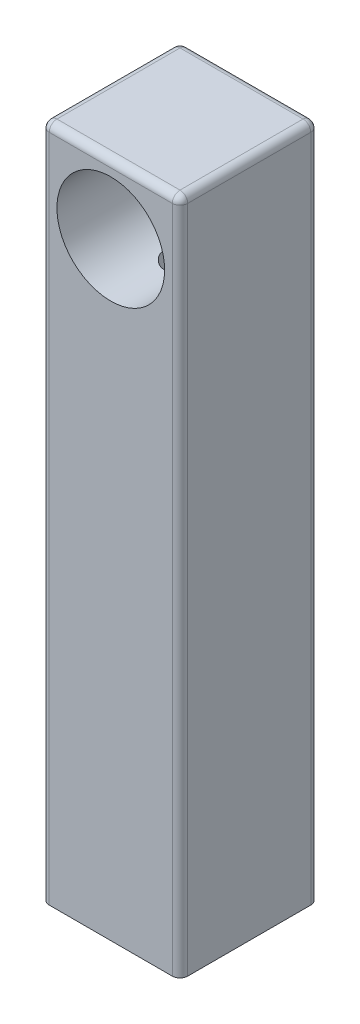
ISO-10303-21;
HEADER;
FILE_DESCRIPTION(('STEP AP214'),'2;1');
FILE_NAME('part.step','',(''),(''),'','','');
FILE_SCHEMA(('AUTOMOTIVE_DESIGN { 1 0 10303 214 1 1 1 1 }'));
ENDSEC;
DATA;
#1=APPLICATION_CONTEXT('core data for automotive mechanical design processes');
#2=APPLICATION_PROTOCOL_DEFINITION('international standard','automotive_design',2000,#1);
#3=PRODUCT_CONTEXT('',#1,'mechanical');
#4=PRODUCT('Part','Part','',(#3));
#5=PRODUCT_RELATED_PRODUCT_CATEGORY('part','',(#4));
#6=PRODUCT_DEFINITION_FORMATION('','',#4);
#7=PRODUCT_DEFINITION_CONTEXT('part definition',#1,'design');
#8=PRODUCT_DEFINITION('design','',#6,#7);
#9=PRODUCT_DEFINITION_SHAPE('','',#8);
#10=(LENGTH_UNIT() NAMED_UNIT(*) SI_UNIT(.MILLI.,.METRE.));
#11=(NAMED_UNIT(*) PLANE_ANGLE_UNIT() SI_UNIT($,.RADIAN.));
#12=(NAMED_UNIT(*) SI_UNIT($,.STERADIAN.) SOLID_ANGLE_UNIT());
#13=UNCERTAINTY_MEASURE_WITH_UNIT(LENGTH_MEASURE(1.E-05),#10,'distance_accuracy_value','');
#14=(GEOMETRIC_REPRESENTATION_CONTEXT(3) GLOBAL_UNCERTAINTY_ASSIGNED_CONTEXT((#13)) GLOBAL_UNIT_ASSIGNED_CONTEXT((#10,
#11,#12)) REPRESENTATION_CONTEXT('',''));
#15=CARTESIAN_POINT('',(0.,0.,0.));
#16=DIRECTION('',(0.,0.,1.));
#17=DIRECTION('',(1.,0.,0.));
#18=AXIS2_PLACEMENT_3D('',#15,#16,#17);
#19=CARTESIAN_POINT('',(-24.257,279.4,-24.3295714285714));
#20=DIRECTION('',(0.,-1.,0.));
#21=DIRECTION('',(0.,0.,-1.));
#22=AXIS2_PLACEMENT_3D('',#19,#20,#21);
#23=CYLINDRICAL_SURFACE('',#22,3.175);
#24=DIRECTION('',(0.,-1.,0.));
#25=VECTOR('',#24,1.);
#26=CARTESIAN_POINT('',(-27.432,279.4,-24.3295714285714));
#27=LINE('',#26,#25);
#28=CARTESIAN_POINT('',(-27.432,276.225,-24.3295714285714));
#29=VERTEX_POINT('',#28);
#30=CARTESIAN_POINT('',(-27.432,0.,-24.3295714285714));
#31=VERTEX_POINT('',#30);
#32=EDGE_CURVE('E114',#29,#31,#27,.T.);
#33=ORIENTED_EDGE('',*,*,#32,.F.);
#34=CARTESIAN_POINT('',(-24.257,276.225,-24.3295714285714));
#35=DIRECTION('',(0.,-1.,0.));
#36=DIRECTION('',(0.,0.,-1.));
#37=AXIS2_PLACEMENT_3D('',#34,#35,#36);
#38=CIRCLE('',#37,3.175);
#39=CARTESIAN_POINT('',(-24.257,276.225,-27.5045714285714));
#40=VERTEX_POINT('',#39);
#41=EDGE_CURVE('E187',#29,#40,#38,.T.);
#42=ORIENTED_EDGE('',*,*,#41,.T.);
#43=DIRECTION('',(0.,-1.,0.));
#44=VECTOR('',#43,1.);
#45=CARTESIAN_POINT('',(-24.257,279.4,-27.5045714285714));
#46=LINE('',#45,#44);
#47=CARTESIAN_POINT('',(-24.257,0.,-27.5045714285714));
#48=VERTEX_POINT('',#47);
#49=EDGE_CURVE('E139',#40,#48,#46,.T.);
#50=ORIENTED_EDGE('',*,*,#49,.T.);
#51=CARTESIAN_POINT('',(-24.257,0.,-24.3295714285714));
#52=DIRECTION('',(0.,1.,0.));
#53=DIRECTION('',(0.,0.,1.));
#54=AXIS2_PLACEMENT_3D('',#51,#52,#53);
#55=CIRCLE('',#54,3.175);
#56=EDGE_CURVE('E132',#48,#31,#55,.T.);
#57=ORIENTED_EDGE('',*,*,#56,.T.);
#58=EDGE_LOOP('',(#33,#42,#50,#57));
#59=FACE_BOUND('',#58,.T.);
#60=ADVANCED_FACE('F33',(#59),#23,.T.);
#61=CARTESIAN_POINT('',(-27.432,279.4,-24.3295714285714));
#62=DIRECTION('',(1.,0.,0.));
#63=DIRECTION('',(0.,0.,-1.));
#64=AXIS2_PLACEMENT_3D('',#61,#62,#63);
#65=PLANE('',#64);
#66=DIRECTION('',(0.,-1.,0.));
#67=VECTOR('',#66,1.);
#68=CARTESIAN_POINT('',(-27.432,279.4,26.4704285714285));
#69=LINE('',#68,#67);
#70=CARTESIAN_POINT('',(-27.432,276.225,26.4704285714285));
#71=VERTEX_POINT('',#70);
#72=CARTESIAN_POINT('',(-27.432,0.,26.4704285714285));
#73=VERTEX_POINT('',#72);
#74=EDGE_CURVE('E126',#71,#73,#69,.T.);
#75=ORIENTED_EDGE('',*,*,#74,.F.);
#76=DIRECTION('',(0.,0.,1.));
#77=VECTOR('',#76,1.);
#78=CARTESIAN_POINT('',(-27.432,276.225,-24.3295714285714));
#79=LINE('',#78,#77);
#80=EDGE_CURVE('E121',#71,#29,#79,.F.);
#81=ORIENTED_EDGE('',*,*,#80,.T.);
#82=ORIENTED_EDGE('',*,*,#32,.T.);
#83=DIRECTION('',(0.,0.,1.));
#84=VECTOR('',#83,1.);
#85=CARTESIAN_POINT('',(-27.432,0.,-24.3295714285714));
#86=LINE('',#85,#84);
#87=EDGE_CURVE('E118',#31,#73,#86,.T.);
#88=ORIENTED_EDGE('',*,*,#87,.T.);
#89=EDGE_LOOP('',(#75,#81,#82,#88));
#90=FACE_BOUND('',#89,.T.);
#91=ADVANCED_FACE('F117',(#90),#65,.F.);
#92=CARTESIAN_POINT('',(-24.257,279.4,26.4704285714286));
#93=DIRECTION('',(0.,-1.,0.));
#94=DIRECTION('',(0.,0.,-1.));
#95=AXIS2_PLACEMENT_3D('',#92,#93,#94);
#96=CYLINDRICAL_SURFACE('',#95,3.175);
#97=DIRECTION('',(0.,-1.,0.));
#98=VECTOR('',#97,1.);
#99=CARTESIAN_POINT('',(-24.257,279.4,29.6454285714286));
#100=LINE('',#99,#98);
#101=CARTESIAN_POINT('',(-24.257,276.225,29.6454285714286));
#102=VERTEX_POINT('',#101);
#103=CARTESIAN_POINT('',(-24.257,0.,29.6454285714286));
#104=VERTEX_POINT('',#103);
#105=EDGE_CURVE('E171',#102,#104,#100,.T.);
#106=ORIENTED_EDGE('',*,*,#105,.F.);
#107=CARTESIAN_POINT('',(-24.257,276.225,26.4704285714286));
#108=DIRECTION('',(0.,-1.,0.));
#109=DIRECTION('',(0.,0.,-1.));
#110=AXIS2_PLACEMENT_3D('',#107,#108,#109);
#111=CIRCLE('',#110,3.175);
#112=EDGE_CURVE('E190',#102,#71,#111,.T.);
#113=ORIENTED_EDGE('',*,*,#112,.T.);
#114=ORIENTED_EDGE('',*,*,#74,.T.);
#115=CARTESIAN_POINT('',(-24.257,0.,26.4704285714286));
#116=DIRECTION('',(0.,1.,0.));
#117=DIRECTION('',(0.,0.,1.));
#118=AXIS2_PLACEMENT_3D('',#115,#116,#117);
#119=CIRCLE('',#118,3.175);
#120=EDGE_CURVE('E136',#73,#104,#119,.T.);
#121=ORIENTED_EDGE('',*,*,#120,.T.);
#122=EDGE_LOOP('',(#106,#113,#114,#121));
#123=FACE_BOUND('',#122,.T.);
#124=ADVANCED_FACE('F271',(#123),#96,.T.);
#125=CARTESIAN_POINT('',(-24.257,279.4,29.6454285714286));
#126=DIRECTION('',(0.,0.,-1.));
#127=DIRECTION('',(-1.,0.,0.));
#128=AXIS2_PLACEMENT_3D('',#125,#126,#127);
#129=PLANE('',#128);
#130=CARTESIAN_POINT('',(1.14300000000002,250.825,29.6454285714286));
#131=DIRECTION('',(0.,0.,1.));
#132=DIRECTION('',(1.,0.,0.));
#133=AXIS2_PLACEMENT_3D('',#130,#131,#132);
#134=CIRCLE('',#133,22.225);
#135=CARTESIAN_POINT('',(23.368,250.825,29.6454285714286));
#136=VERTEX_POINT('',#135);
#137=EDGE_CURVE('E230',#136,#136,#134,.T.);
#138=ORIENTED_EDGE('',*,*,#137,.F.);
#139=EDGE_LOOP('',(#138));
#140=FACE_BOUND('',#139,.T.);
#141=DIRECTION('',(0.,-1.,0.));
#142=VECTOR('',#141,1.);
#143=CARTESIAN_POINT('',(26.543,279.4,29.6454285714286));
#144=LINE('',#143,#142);
#145=CARTESIAN_POINT('',(26.543,276.225,29.6454285714286));
#146=VERTEX_POINT('',#145);
#147=CARTESIAN_POINT('',(26.543,0.,29.6454285714286));
#148=VERTEX_POINT('',#147);
#149=EDGE_CURVE('E169',#146,#148,#144,.T.);
#150=ORIENTED_EDGE('',*,*,#149,.F.);
#151=DIRECTION('',(1.,0.,0.));
#152=VECTOR('',#151,1.);
#153=CARTESIAN_POINT('',(-24.257,276.225,29.6454285714286));
#154=LINE('',#153,#152);
#155=EDGE_CURVE('E192',#146,#102,#154,.F.);
#156=ORIENTED_EDGE('',*,*,#155,.T.);
#157=ORIENTED_EDGE('',*,*,#105,.T.);
#158=DIRECTION('',(1.,0.,0.));
#159=VECTOR('',#158,1.);
#160=CARTESIAN_POINT('',(-24.257,0.,29.6454285714286));
#161=LINE('',#160,#159);
#162=EDGE_CURVE('E148',#104,#148,#161,.T.);
#163=ORIENTED_EDGE('',*,*,#162,.T.);
#164=EDGE_LOOP('',(#150,#156,#157,#163));
#165=FACE_BOUND('',#164,.T.);
#166=ADVANCED_FACE('F336',(#140,#165),#129,.F.);
#167=CARTESIAN_POINT('',(26.543,279.4,26.4704285714286));
#168=DIRECTION('',(0.,-1.,0.));
#169=DIRECTION('',(0.,0.,-1.));
#170=AXIS2_PLACEMENT_3D('',#167,#168,#169);
#171=CYLINDRICAL_SURFACE('',#170,3.175);
#172=DIRECTION('',(0.,-1.,0.));
#173=VECTOR('',#172,1.);
#174=CARTESIAN_POINT('',(29.718,279.4,26.4704285714285));
#175=LINE('',#174,#173);
#176=CARTESIAN_POINT('',(29.718,276.225,26.4704285714285));
#177=VERTEX_POINT('',#176);
#178=CARTESIAN_POINT('',(29.718,0.,26.4704285714285));
#179=VERTEX_POINT('',#178);
#180=EDGE_CURVE('E167',#177,#179,#175,.T.);
#181=ORIENTED_EDGE('',*,*,#180,.F.);
#182=CARTESIAN_POINT('',(26.543,276.225,26.4704285714286));
#183=DIRECTION('',(0.,-1.,0.));
#184=DIRECTION('',(0.,0.,-1.));
#185=AXIS2_PLACEMENT_3D('',#182,#183,#184);
#186=CIRCLE('',#185,3.175);
#187=EDGE_CURVE('E46',#177,#146,#186,.T.);
#188=ORIENTED_EDGE('',*,*,#187,.T.);
#189=ORIENTED_EDGE('',*,*,#149,.T.);
#190=CARTESIAN_POINT('',(26.543,0.,26.4704285714286));
#191=DIRECTION('',(0.,1.,0.));
#192=DIRECTION('',(0.,0.,1.));
#193=AXIS2_PLACEMENT_3D('',#190,#191,#192);
#194=CIRCLE('',#193,3.175);
#195=EDGE_CURVE('E151',#148,#179,#194,.T.);
#196=ORIENTED_EDGE('',*,*,#195,.T.);
#197=EDGE_LOOP('',(#181,#188,#189,#196));
#198=FACE_BOUND('',#197,.T.);
#199=ADVANCED_FACE('F334',(#198),#171,.T.);
#200=CARTESIAN_POINT('',(29.718,279.4,-24.3295714285714));
#201=DIRECTION('',(1.,0.,0.));
#202=DIRECTION('',(0.,0.,-1.));
#203=AXIS2_PLACEMENT_3D('',#200,#201,#202);
#204=PLANE('',#203);
#205=DIRECTION('',(0.,-1.,0.));
#206=VECTOR('',#205,1.);
#207=CARTESIAN_POINT('',(29.718,279.4,-24.3295714285714));
#208=LINE('',#207,#206);
#209=CARTESIAN_POINT('',(29.718,276.225,-24.3295714285714));
#210=VERTEX_POINT('',#209);
#211=CARTESIAN_POINT('',(29.718,0.,-24.3295714285714));
#212=VERTEX_POINT('',#211);
#213=EDGE_CURVE('E165',#210,#212,#208,.T.);
#214=ORIENTED_EDGE('',*,*,#213,.F.);
#215=DIRECTION('',(0.,0.,1.));
#216=VECTOR('',#215,1.);
#217=CARTESIAN_POINT('',(29.718,276.225,-24.3295714285714));
#218=LINE('',#217,#216);
#219=EDGE_CURVE('E11',#210,#177,#218,.T.);
#220=ORIENTED_EDGE('',*,*,#219,.T.);
#221=ORIENTED_EDGE('',*,*,#180,.T.);
#222=DIRECTION('',(0.,0.,1.));
#223=VECTOR('',#222,1.);
#224=CARTESIAN_POINT('',(29.718,0.,-24.3295714285714));
#225=LINE('',#224,#223);
#226=EDGE_CURVE('E154',#212,#179,#225,.T.);
#227=ORIENTED_EDGE('',*,*,#226,.F.);
#228=EDGE_LOOP('',(#214,#220,#221,#227));
#229=FACE_BOUND('',#228,.T.);
#230=ADVANCED_FACE('F333',(#229),#204,.T.);
#231=CARTESIAN_POINT('',(26.543,279.4,-24.3295714285714));
#232=DIRECTION('',(0.,-1.,0.));
#233=DIRECTION('',(0.,0.,-1.));
#234=AXIS2_PLACEMENT_3D('',#231,#232,#233);
#235=CYLINDRICAL_SURFACE('',#234,3.175);
#236=DIRECTION('',(0.,-1.,0.));
#237=VECTOR('',#236,1.);
#238=CARTESIAN_POINT('',(26.543,279.4,-27.5045714285714));
#239=LINE('',#238,#237);
#240=CARTESIAN_POINT('',(26.543,276.225,-27.5045714285714));
#241=VERTEX_POINT('',#240);
#242=CARTESIAN_POINT('',(26.543,0.,-27.5045714285714));
#243=VERTEX_POINT('',#242);
#244=EDGE_CURVE('E163',#241,#243,#239,.T.);
#245=ORIENTED_EDGE('',*,*,#244,.F.);
#246=CARTESIAN_POINT('',(26.543,276.225,-24.3295714285714));
#247=DIRECTION('',(0.,-1.,0.));
#248=DIRECTION('',(0.,0.,-1.));
#249=AXIS2_PLACEMENT_3D('',#246,#247,#248);
#250=CIRCLE('',#249,3.175);
#251=EDGE_CURVE('E125',#241,#210,#250,.T.);
#252=ORIENTED_EDGE('',*,*,#251,.T.);
#253=ORIENTED_EDGE('',*,*,#213,.T.);
#254=CARTESIAN_POINT('',(26.543,0.,-24.3295714285714));
#255=DIRECTION('',(0.,-1.,0.));
#256=DIRECTION('',(0.,0.,-1.));
#257=AXIS2_PLACEMENT_3D('',#254,#255,#256);
#258=CIRCLE('',#257,3.175);
#259=EDGE_CURVE('E157',#243,#212,#258,.T.);
#260=ORIENTED_EDGE('',*,*,#259,.F.);
#261=EDGE_LOOP('',(#245,#252,#253,#260));
#262=FACE_BOUND('',#261,.T.);
#263=ADVANCED_FACE('F330',(#262),#235,.T.);
#264=CARTESIAN_POINT('',(-24.257,279.4,-27.5045714285714));
#265=DIRECTION('',(0.,0.,-1.));
#266=DIRECTION('',(-1.,0.,0.));
#267=AXIS2_PLACEMENT_3D('',#264,#265,#266);
#268=PLANE('',#267);
#269=ORIENTED_EDGE('',*,*,#49,.F.);
#270=DIRECTION('',(1.,0.,0.));
#271=VECTOR('',#270,1.);
#272=CARTESIAN_POINT('',(-24.257,276.225,-27.5045714285714));
#273=LINE('',#272,#271);
#274=EDGE_CURVE('E176',#40,#241,#273,.T.);
#275=ORIENTED_EDGE('',*,*,#274,.T.);
#276=ORIENTED_EDGE('',*,*,#244,.T.);
#277=DIRECTION('',(1.,0.,0.));
#278=VECTOR('',#277,1.);
#279=CARTESIAN_POINT('',(-24.257,0.,-27.5045714285714));
#280=LINE('',#279,#278);
#281=EDGE_CURVE('E160',#48,#243,#280,.T.);
#282=ORIENTED_EDGE('',*,*,#281,.F.);
#283=EDGE_LOOP('',(#269,#275,#276,#282));
#284=FACE_BOUND('',#283,.T.);
#285=ADVANCED_FACE('F324',(#284),#268,.T.);
#286=CARTESIAN_POINT('',(-24.257,279.4,-24.3295714285714));
#287=DIRECTION('',(0.,1.,0.));
#288=DIRECTION('',(0.,0.,1.));
#289=AXIS2_PLACEMENT_3D('',#286,#287,#288);
#290=PLANE('',#289);
#291=DIRECTION('',(0.,0.,1.));
#292=VECTOR('',#291,1.);
#293=CARTESIAN_POINT('',(26.543,279.4,-24.3295714285714));
#294=LINE('',#293,#292);
#295=CARTESIAN_POINT('',(26.543,279.4,26.4704285714286));
#296=VERTEX_POINT('',#295);
#297=CARTESIAN_POINT('',(26.543,279.4,-24.3295714285714));
#298=VERTEX_POINT('',#297);
#299=EDGE_CURVE('E178',#296,#298,#294,.F.);
#300=ORIENTED_EDGE('',*,*,#299,.T.);
#301=DIRECTION('',(1.,0.,0.));
#302=VECTOR('',#301,1.);
#303=CARTESIAN_POINT('',(-24.257,279.4,-24.3295714285714));
#304=LINE('',#303,#302);
#305=CARTESIAN_POINT('',(-24.257,279.4,-24.3295714285714));
#306=VERTEX_POINT('',#305);
#307=EDGE_CURVE('E184',#298,#306,#304,.F.);
#308=ORIENTED_EDGE('',*,*,#307,.T.);
#309=DIRECTION('',(0.,0.,1.));
#310=VECTOR('',#309,1.);
#311=CARTESIAN_POINT('',(-24.257,279.4,26.4704285714285));
#312=LINE('',#311,#310);
#313=CARTESIAN_POINT('',(-24.257,279.4,26.4704285714286));
#314=VERTEX_POINT('',#313);
#315=EDGE_CURVE('E182',#306,#314,#312,.T.);
#316=ORIENTED_EDGE('',*,*,#315,.T.);
#317=DIRECTION('',(1.,0.,0.));
#318=VECTOR('',#317,1.);
#319=CARTESIAN_POINT('',(26.543,279.4,26.4704285714286));
#320=LINE('',#319,#318);
#321=EDGE_CURVE('E180',#314,#296,#320,.T.);
#322=ORIENTED_EDGE('',*,*,#321,.T.);
#323=EDGE_LOOP('',(#300,#308,#316,#322));
#324=FACE_BOUND('',#323,.T.);
#325=ADVANCED_FACE('F317',(#324),#290,.T.);
#326=CARTESIAN_POINT('',(-24.257,0.,-24.3295714285714));
#327=DIRECTION('',(0.,1.,0.));
#328=DIRECTION('',(0.,0.,1.));
#329=AXIS2_PLACEMENT_3D('',#326,#327,#328);
#330=PLANE('',#329);
#331=CARTESIAN_POINT('',(1.14300000000001,0.,1.07042857142859));
#332=DIRECTION('',(0.,1.,0.));
#333=DIRECTION('',(0.,0.,1.));
#334=AXIS2_PLACEMENT_3D('',#331,#332,#333);
#335=CIRCLE('',#334,6.35);
#336=CARTESIAN_POINT('',(1.14300000000001,0.,7.42042857142859));
#337=VERTEX_POINT('',#336);
#338=EDGE_CURVE('E215',#337,#337,#335,.T.);
#339=ORIENTED_EDGE('',*,*,#338,.T.);
#340=EDGE_LOOP('',(#339));
#341=FACE_BOUND('',#340,.T.);
#342=CARTESIAN_POINT('',(15.4305,0.,15.3579285714286));
#343=DIRECTION('',(0.,1.,0.));
#344=DIRECTION('',(0.,0.,1.));
#345=AXIS2_PLACEMENT_3D('',#342,#343,#344);
#346=CIRCLE('',#345,4.96062);
#347=CARTESIAN_POINT('',(15.4305,0.,20.3185485714286));
#348=VERTEX_POINT('',#347);
#349=EDGE_CURVE('E232',#348,#348,#346,.T.);
#350=ORIENTED_EDGE('',*,*,#349,.T.);
#351=EDGE_LOOP('',(#350));
#352=FACE_BOUND('',#351,.T.);
#353=CARTESIAN_POINT('',(-13.1445,0.,-13.2170714285714));
#354=DIRECTION('',(0.,1.,0.));
#355=DIRECTION('',(0.,0.,1.));
#356=AXIS2_PLACEMENT_3D('',#353,#354,#355);
#357=CIRCLE('',#356,4.96062);
#358=CARTESIAN_POINT('',(-13.1445,0.,-8.25645142857141));
#359=VERTEX_POINT('',#358);
#360=EDGE_CURVE('E238',#359,#359,#357,.T.);
#361=ORIENTED_EDGE('',*,*,#360,.T.);
#362=EDGE_LOOP('',(#361));
#363=FACE_BOUND('',#362,.T.);
#364=CARTESIAN_POINT('',(15.4305,0.,-13.2170714285714));
#365=DIRECTION('',(0.,1.,0.));
#366=DIRECTION('',(0.,0.,1.));
#367=AXIS2_PLACEMENT_3D('',#364,#365,#366);
#368=CIRCLE('',#367,4.96062);
#369=CARTESIAN_POINT('',(15.4305,0.,-8.25645142857141));
#370=VERTEX_POINT('',#369);
#371=EDGE_CURVE('E226',#370,#370,#368,.T.);
#372=ORIENTED_EDGE('',*,*,#371,.T.);
#373=EDGE_LOOP('',(#372));
#374=FACE_BOUND('',#373,.T.);
#375=CARTESIAN_POINT('',(-13.1445,0.,15.3579285714286));
#376=DIRECTION('',(0.,1.,0.));
#377=DIRECTION('',(0.,0.,1.));
#378=AXIS2_PLACEMENT_3D('',#375,#376,#377);
#379=CIRCLE('',#378,4.96062);
#380=CARTESIAN_POINT('',(-13.1445,0.,20.3185485714286));
#381=VERTEX_POINT('',#380);
#382=EDGE_CURVE('E143',#381,#381,#379,.T.);
#383=ORIENTED_EDGE('',*,*,#382,.T.);
#384=EDGE_LOOP('',(#383));
#385=FACE_BOUND('',#384,.T.);
#386=ORIENTED_EDGE('',*,*,#56,.F.);
#387=ORIENTED_EDGE('',*,*,#281,.T.);
#388=ORIENTED_EDGE('',*,*,#259,.T.);
#389=ORIENTED_EDGE('',*,*,#226,.T.);
#390=ORIENTED_EDGE('',*,*,#195,.F.);
#391=ORIENTED_EDGE('',*,*,#162,.F.);
#392=ORIENTED_EDGE('',*,*,#120,.F.);
#393=ORIENTED_EDGE('',*,*,#87,.F.);
#394=EDGE_LOOP('',(#386,#387,#388,#389,#390,#391,#392,#393));
#395=FACE_BOUND('',#394,.T.);
#396=ADVANCED_FACE('F130',(#341,#352,#363,#374,#385,#395),#330,.F.);
#397=CARTESIAN_POINT('',(-13.1445,25.4,15.3579285714286));
#398=DIRECTION('',(0.,-1.,0.));
#399=DIRECTION('',(0.,0.,-1.));
#400=AXIS2_PLACEMENT_3D('',#397,#398,#399);
#401=CYLINDRICAL_SURFACE('',#400,4.96062);
#402=CARTESIAN_POINT('',(-13.1445,25.4,15.3579285714286));
#403=DIRECTION('',(0.,1.,0.));
#404=DIRECTION('',(0.,0.,1.));
#405=AXIS2_PLACEMENT_3D('',#402,#403,#404);
#406=CIRCLE('',#405,4.96062);
#407=CARTESIAN_POINT('',(-13.1445,25.4,20.3185485714286));
#408=VERTEX_POINT('',#407);
#409=EDGE_CURVE('E140',#408,#408,#406,.T.);
#410=ORIENTED_EDGE('',*,*,#409,.T.);
#411=EDGE_LOOP('',(#410));
#412=FACE_BOUND('',#411,.T.);
#413=ORIENTED_EDGE('',*,*,#382,.F.);
#414=EDGE_LOOP('',(#413));
#415=FACE_BOUND('',#414,.T.);
#416=ADVANCED_FACE('F262',(#412,#415),#401,.F.);
#417=CARTESIAN_POINT('',(-13.1445,25.4,15.3579285714286));
#418=DIRECTION('',(0.,1.,0.));
#419=DIRECTION('',(0.,0.,1.));
#420=AXIS2_PLACEMENT_3D('',#417,#418,#419);
#421=PLANE('',#420);
#422=ORIENTED_EDGE('',*,*,#409,.F.);
#423=EDGE_LOOP('',(#422));
#424=FACE_BOUND('',#423,.T.);
#425=ADVANCED_FACE('F252',(#424),#421,.F.);
#426=CARTESIAN_POINT('',(15.4305,25.4,-13.2170714285714));
#427=DIRECTION('',(0.,-1.,0.));
#428=DIRECTION('',(0.,0.,-1.));
#429=AXIS2_PLACEMENT_3D('',#426,#427,#428);
#430=CYLINDRICAL_SURFACE('',#429,4.96062);
#431=CARTESIAN_POINT('',(15.4305,25.4,-13.2170714285714));
#432=DIRECTION('',(0.,1.,0.));
#433=DIRECTION('',(0.,0.,1.));
#434=AXIS2_PLACEMENT_3D('',#431,#432,#433);
#435=CIRCLE('',#434,4.96062);
#436=CARTESIAN_POINT('',(15.4305,25.4,-8.25645142857141));
#437=VERTEX_POINT('',#436);
#438=EDGE_CURVE('E221',#437,#437,#435,.T.);
#439=ORIENTED_EDGE('',*,*,#438,.T.);
#440=EDGE_LOOP('',(#439));
#441=FACE_BOUND('',#440,.T.);
#442=ORIENTED_EDGE('',*,*,#371,.F.);
#443=EDGE_LOOP('',(#442));
#444=FACE_BOUND('',#443,.T.);
#445=ADVANCED_FACE('F249',(#441,#444),#430,.F.);
#446=CARTESIAN_POINT('',(15.4305,25.4,-13.2170714285714));
#447=DIRECTION('',(0.,1.,0.));
#448=DIRECTION('',(0.,0.,1.));
#449=AXIS2_PLACEMENT_3D('',#446,#447,#448);
#450=PLANE('',#449);
#451=ORIENTED_EDGE('',*,*,#438,.F.);
#452=EDGE_LOOP('',(#451));
#453=FACE_BOUND('',#452,.T.);
#454=ADVANCED_FACE('F251',(#453),#450,.F.);
#455=CARTESIAN_POINT('',(-13.1445,25.4,-13.2170714285714));
#456=DIRECTION('',(0.,-1.,0.));
#457=DIRECTION('',(0.,0.,-1.));
#458=AXIS2_PLACEMENT_3D('',#455,#456,#457);
#459=CYLINDRICAL_SURFACE('',#458,4.96062);
#460=CARTESIAN_POINT('',(-13.1445,25.4,-13.2170714285714));
#461=DIRECTION('',(0.,1.,0.));
#462=DIRECTION('',(0.,0.,1.));
#463=AXIS2_PLACEMENT_3D('',#460,#461,#462);
#464=CIRCLE('',#463,4.96062);
#465=CARTESIAN_POINT('',(-13.1445,25.4,-8.25645142857141));
#466=VERTEX_POINT('',#465);
#467=EDGE_CURVE('E241',#466,#466,#464,.T.);
#468=ORIENTED_EDGE('',*,*,#467,.T.);
#469=EDGE_LOOP('',(#468));
#470=FACE_BOUND('',#469,.T.);
#471=ORIENTED_EDGE('',*,*,#360,.F.);
#472=EDGE_LOOP('',(#471));
#473=FACE_BOUND('',#472,.T.);
#474=ADVANCED_FACE('F259',(#470,#473),#459,.F.);
#475=CARTESIAN_POINT('',(-13.1445,25.4,-13.2170714285714));
#476=DIRECTION('',(0.,1.,0.));
#477=DIRECTION('',(0.,0.,1.));
#478=AXIS2_PLACEMENT_3D('',#475,#476,#477);
#479=PLANE('',#478);
#480=ORIENTED_EDGE('',*,*,#467,.F.);
#481=EDGE_LOOP('',(#480));
#482=FACE_BOUND('',#481,.T.);
#483=ADVANCED_FACE('F391',(#482),#479,.F.);
#484=CARTESIAN_POINT('',(15.4305,25.4,15.3579285714286));
#485=DIRECTION('',(0.,-1.,0.));
#486=DIRECTION('',(0.,0.,-1.));
#487=AXIS2_PLACEMENT_3D('',#484,#485,#486);
#488=CYLINDRICAL_SURFACE('',#487,4.96062);
#489=CARTESIAN_POINT('',(15.4305,25.4,15.3579285714286));
#490=DIRECTION('',(0.,1.,0.));
#491=DIRECTION('',(0.,0.,1.));
#492=AXIS2_PLACEMENT_3D('',#489,#490,#491);
#493=CIRCLE('',#492,4.96062);
#494=CARTESIAN_POINT('',(15.4305,25.4,20.3185485714286));
#495=VERTEX_POINT('',#494);
#496=EDGE_CURVE('E235',#495,#495,#493,.T.);
#497=ORIENTED_EDGE('',*,*,#496,.T.);
#498=EDGE_LOOP('',(#497));
#499=FACE_BOUND('',#498,.T.);
#500=ORIENTED_EDGE('',*,*,#349,.F.);
#501=EDGE_LOOP('',(#500));
#502=FACE_BOUND('',#501,.T.);
#503=ADVANCED_FACE('F401',(#499,#502),#488,.F.);
#504=CARTESIAN_POINT('',(15.4305,25.4,15.3579285714286));
#505=DIRECTION('',(0.,1.,0.));
#506=DIRECTION('',(0.,0.,1.));
#507=AXIS2_PLACEMENT_3D('',#504,#505,#506);
#508=PLANE('',#507);
#509=ORIENTED_EDGE('',*,*,#496,.F.);
#510=EDGE_LOOP('',(#509));
#511=FACE_BOUND('',#510,.T.);
#512=ADVANCED_FACE('F309',(#511),#508,.F.);
#513=CARTESIAN_POINT('',(1.14300000000001,250.825,1.07042857142859));
#514=DIRECTION('',(0.,-1.,0.));
#515=DIRECTION('',(0.,0.,-1.));
#516=AXIS2_PLACEMENT_3D('',#513,#514,#515);
#517=CYLINDRICAL_SURFACE('',#516,6.35);
#518=CARTESIAN_POINT('',(1.14300000000001,228.6,-5.27957142857141));
#519=CARTESIAN_POINT('',(1.31760722584368,228.59999533922,-5.27957842871673));
#520=CARTESIAN_POINT('',(1.49214567641464,228.602060246657,-5.27236932431137));
#521=CARTESIAN_POINT('',(1.83998851914443,228.610251883289,-5.24361370881612));
#522=CARTESIAN_POINT('',(2.01329282827669,228.616378883199,-5.22206624215612));
#523=CARTESIAN_POINT('',(2.35737514514276,228.63253262263,-5.16481222225493));
#524=CARTESIAN_POINT('',(2.52815279448038,228.642559909989,-5.12910367992376));
#525=CARTESIAN_POINT('',(2.86602009773866,228.666242978592,-5.04382256308965));
#526=CARTESIAN_POINT('',(3.03310836488565,228.6799000999,-4.99424486800641));
#527=CARTESIAN_POINT('',(3.36208341514641,228.710445100408,-4.8817421259483));
#528=CARTESIAN_POINT('',(3.52397899653581,228.727327136412,-4.81884119713526));
#529=CARTESIAN_POINT('',(3.84186904106691,228.763895209268,-4.68011024616492));
#530=CARTESIAN_POINT('',(3.99786129536685,228.783582282803,-4.60427544186949));
#531=CARTESIAN_POINT('',(4.30284930758176,228.825235212901,-4.44027113496639));
#532=CARTESIAN_POINT('',(4.45184717023757,228.847200377476,-4.35210537516312));
#533=CARTESIAN_POINT('',(4.7419957556658,228.892843961601,-4.16404016289287));
#534=CARTESIAN_POINT('',(4.88314344013892,228.916523036447,-4.06413621325318));
#535=CARTESIAN_POINT('',(5.29983584601097,228.990350552366,-3.74287950922725));
#536=CARTESIAN_POINT('',(5.5616521664173,229.04229610688,-3.50373022027188));
#537=CARTESIAN_POINT('',(6.04200472413623,229.145262979558,-2.98508644717563));
#538=CARTESIAN_POINT('',(6.26053447188943,229.196284158098,-2.70558592438658));
#539=CARTESIAN_POINT('',(6.55337724738395,229.268357835586,-2.25868769750916));
#540=CARTESIAN_POINT('',(6.64593063287321,229.291857167608,-2.10336775932919));
#541=CARTESIAN_POINT('',(6.81757190710558,229.336451362042,-1.7851562436931));
#542=CARTESIAN_POINT('',(6.89666509906434,229.357547170336,-1.62226768057027));
#543=CARTESIAN_POINT('',(7.04077555732773,229.39669044416,-1.28998616268928));
#544=CARTESIAN_POINT('',(7.10578946902985,229.414737182978,-1.12059166908887));
#545=CARTESIAN_POINT('',(7.22114329403664,229.447198614505,-0.776612382145149));
#546=CARTESIAN_POINT('',(7.27148952764156,229.461614871223,-0.60202986016605));
#547=CARTESIAN_POINT('',(7.35600222204908,229.486042305683,-0.253377725811255));
#548=CARTESIAN_POINT('',(7.39054512308765,229.496155520362,-0.0794064696418197));
#549=CARTESIAN_POINT('',(7.44496230031208,229.512170457215,0.270939771570803));
#550=CARTESIAN_POINT('',(7.46484241546691,229.518073855779,0.447313771273361));
#551=CARTESIAN_POINT('',(7.4897693003918,229.525485584221,0.801199719838219));
#552=CARTESIAN_POINT('',(7.49481603244561,229.526993902925,0.978711671592795));
#553=CARTESIAN_POINT('',(7.4900277142954,229.525566414641,1.33351494321212));
#554=CARTESIAN_POINT('',(7.48019294866635,229.522630692635,1.51080626723099));
#555=CARTESIAN_POINT('',(7.4462995274518,229.512577854046,1.85805057858543));
#556=CARTESIAN_POINT('',(7.42271560711653,229.505600342816,2.02805421134306));
#557=CARTESIAN_POINT('',(7.36190625958518,229.487782920299,2.36545724063313));
#558=CARTESIAN_POINT('',(7.32467618266817,229.476941692543,2.53285572921118));
#559=CARTESIAN_POINT('',(7.23690177541063,229.451720713729,2.86379406628591));
#560=CARTESIAN_POINT('',(7.18636144410367,229.437342025578,3.02733505770518));
#561=CARTESIAN_POINT('',(7.07234452393346,229.405452835512,3.34959477197328));
#562=CARTESIAN_POINT('',(7.00886304528277,229.387941150108,3.50831164591323));
#563=CARTESIAN_POINT('',(6.86859900968918,229.350049946366,3.82176623048403));
#564=CARTESIAN_POINT('',(6.79166282309199,229.329637879736,3.97643123306526));
#565=CARTESIAN_POINT('',(6.6255674670226,229.286675173532,4.27881158894313));
#566=CARTESIAN_POINT('',(6.53640383819615,229.264123754664,4.42652438024365));
#567=CARTESIAN_POINT('',(6.34650077301856,229.217506891265,4.71401937429776));
#568=CARTESIAN_POINT('',(6.2457633223752,229.193441706769,4.85380293133235));
#569=CARTESIAN_POINT('',(6.03331372703302,229.144424761329,5.12468211094829));
#570=CARTESIAN_POINT('',(5.9215974617693,229.119472669772,5.25577444039027));
#571=CARTESIAN_POINT('',(5.68354298598352,229.06840426983,5.51315679438729));
#572=CARTESIAN_POINT('',(5.55681438091845,229.042279299126,5.63908431650598));
#573=CARTESIAN_POINT('',(5.29310088279961,228.990500989422,5.87990458915076));
#574=CARTESIAN_POINT('',(5.15611235678541,228.964847821526,5.99479339776463));
#575=CARTESIAN_POINT('',(4.87281121559587,228.914732548707,6.21269846345988));
#576=CARTESIAN_POINT('',(4.72649950159209,228.89027032907,6.31571586532632));
#577=CARTESIAN_POINT('',(4.42549151919091,228.843210372326,6.50915584615531));
#578=CARTESIAN_POINT('',(4.27079542709759,228.820612596037,6.59957868980964));
#579=CARTESIAN_POINT('',(3.95311620068694,228.777784637288,6.7676405786216));
#580=CARTESIAN_POINT('',(3.79009000503636,228.757569028338,6.84520200842314));
#581=CARTESIAN_POINT('',(3.45777969497402,228.720241201541,6.98624319001617));
#582=CARTESIAN_POINT('',(3.28849787853618,228.703127857469,7.04972805394325));
#583=CARTESIAN_POINT('',(2.94484247289217,228.6724889827,7.16210685178105));
#584=CARTESIAN_POINT('',(2.77046898352204,228.658963381708,7.21100107157027));
#585=CARTESIAN_POINT('',(2.41793292683385,228.635895279872,7.29375768651117));
#586=CARTESIAN_POINT('',(2.23977047966623,228.626352652922,7.32762055757458));
#587=CARTESIAN_POINT('',(1.88695272443264,228.61177649079,7.37913383723418));
#588=CARTESIAN_POINT('',(1.71237573055765,228.606604532987,7.39728243272256));
#589=CARTESIAN_POINT('',(1.36218232986834,228.600390661004,7.41906981635836));
#590=CARTESIAN_POINT('',(1.18656558571635,228.599350170142,7.42270360405877));
#591=CARTESIAN_POINT('',(0.835742781154687,228.601431988277,7.41541571332339));
#592=CARTESIAN_POINT('',(0.66053656658792,228.604552342184,7.40450087097596));
#593=CARTESIAN_POINT('',(0.311686353338763,228.614867087812,7.36822033809641));
#594=CARTESIAN_POINT('',(0.138042921538929,228.622062901788,7.34284960272757));
#595=CARTESIAN_POINT('',(-0.202837246337638,228.640142850337,7.2785435349425));
#596=CARTESIAN_POINT('',(-0.370132423850714,228.650948797428,7.23989529941775));
#597=CARTESIAN_POINT('',(-0.700808940477075,228.675993493553,7.1492655903463));
#598=CARTESIAN_POINT('',(-0.864190215685217,228.690232298597,7.09728389925655));
#599=CARTESIAN_POINT('',(-1.18599182418066,228.721774693854,6.98038711162552));
#600=CARTESIAN_POINT('',(-1.34441102805871,228.739078975915,6.91546909506778));
#601=CARTESIAN_POINT('',(-1.6551925702064,228.776298621686,6.77321877930556));
#602=CARTESIAN_POINT('',(-1.8075567032333,228.796213204051,6.69589019342518));
#603=CARTESIAN_POINT('',(-2.10861632407703,228.838612586089,6.52752368417431));
#604=CARTESIAN_POINT('',(-2.25715762640931,228.86114424793,6.43622184981316));
#605=CARTESIAN_POINT('',(-2.54601354818145,228.907810276177,6.24188598094059));
#606=CARTESIAN_POINT('',(-2.68633083327725,228.931944117797,6.13885578016779));
#607=CARTESIAN_POINT('',(-2.95800910871131,228.981204047354,5.92166407941629));
#608=CARTESIAN_POINT('',(-3.08936517184334,229.006330669359,5.80749653822276));
#609=CARTESIAN_POINT('',(-3.34219196953456,229.056897283529,5.56884637905211));
#610=CARTESIAN_POINT('',(-3.46366604163567,229.082337166524,5.44436727260936));
#611=CARTESIAN_POINT('',(-3.69988259165127,229.13370668926,5.18153929091113));
#612=CARTESIAN_POINT('',(-3.81426865795672,229.1596246267,5.04286751363192));
#613=CARTESIAN_POINT('',(-4.03092399901036,229.210340306912,4.75624891912528));
#614=CARTESIAN_POINT('',(-4.13319763987136,229.235138451326,4.60830547360184));
#615=CARTESIAN_POINT('',(-4.32498433200694,229.282912209444,4.30400304684337));
#616=CARTESIAN_POINT('',(-4.4144925188089,229.305887126908,4.14764088862785));
#617=CARTESIAN_POINT('',(-4.57998911056295,229.349308137979,3.82766003370589));
#618=CARTESIAN_POINT('',(-4.65598304617394,229.369755265026,3.66404433988971));
#619=CARTESIAN_POINT('',(-4.79353964476609,229.407409428053,3.33145058337199));
#620=CARTESIAN_POINT('',(-4.85517191871734,229.424632009965,3.16250309289617));
#621=CARTESIAN_POINT('',(-4.96393814807913,229.45541580075,2.81974836415581));
#622=CARTESIAN_POINT('',(-5.01107783400496,229.468978456535,2.64594307644629));
#623=CARTESIAN_POINT('',(-5.09046315011018,229.492014429613,2.2947048384205));
#624=CARTESIAN_POINT('',(-5.12270961812216,229.50148797694,2.11727209275698));
#625=CARTESIAN_POINT('',(-5.17200611155079,229.516035063215,1.76013096926073));
#626=CARTESIAN_POINT('',(-5.18905664749831,229.521108749982,1.58042266808455));
#627=CARTESIAN_POINT('',(-5.2074416045372,229.526582175657,1.22698137078993));
#628=CARTESIAN_POINT('',(-5.20934805550103,229.527152031195,1.05328051299878));
#629=CARTESIAN_POINT('',(-5.19892685087218,229.52404652313,0.706283299097216));
#630=CARTESIAN_POINT('',(-5.18659431580944,229.52036970426,0.53298710205433));
#631=CARTESIAN_POINT('',(-5.14780675631152,229.50888444609,0.188195154496306));
#632=CARTESIAN_POINT('',(-5.12135749705271,229.501077693438,0.0166986981118238));
#633=CARTESIAN_POINT('',(-5.05456182631832,229.481568664901,-0.323404993091768));
#634=CARTESIAN_POINT('',(-5.0142102291451,229.469864935462,-0.49201112512317));
#635=CARTESIAN_POINT('',(-4.92045639768135,229.44305739714,-0.823330587151491));
#636=CARTESIAN_POINT('',(-4.86719706330065,229.427990951803,-0.986087441140767));
#637=CARTESIAN_POINT('',(-4.74781536445782,229.394816714387,-1.30655326739099));
#638=CARTESIAN_POINT('',(-4.68168863175084,229.376707889761,-1.46426050416679));
#639=CARTESIAN_POINT('',(-4.5370809301566,229.337959603963,-1.77356967684102));
#640=CARTESIAN_POINT('',(-4.45860050110818,229.317320253379,-1.92517187915734));
#641=CARTESIAN_POINT('',(-4.28983234031517,229.274070945685,-2.22136247750889));
#642=CARTESIAN_POINT('',(-4.19954418492378,229.25146091788,-2.36595062163296));
#643=CARTESIAN_POINT('',(-4.00453713175859,229.204086837576,-2.65197890209011));
#644=CARTESIAN_POINT('',(-3.8994356320311,229.179275961435,-2.79315055252727));
#645=CARTESIAN_POINT('',(-3.6779959714566,229.12888262627,-3.06616211564732));
#646=CARTESIAN_POINT('',(-3.56166127448597,229.103300406759,-3.19800488339889));
#647=CARTESIAN_POINT('',(-3.31840202246054,229.052035740796,-3.45166034991214));
#648=CARTESIAN_POINT('',(-3.19147133047579,229.026353244588,-3.57346715381494));
#649=CARTESIAN_POINT('',(-2.92792330829058,228.97560165633,-3.80614528049893));
#650=CARTESIAN_POINT('',(-2.79130945468406,228.950532348429,-3.91702049426018));
#651=CARTESIAN_POINT('',(-2.50551861662805,228.901028957851,-4.12989637518615));
#652=CARTESIAN_POINT('',(-2.35610683664382,228.8766285179,-4.23158999386099));
#653=CARTESIAN_POINT('',(-2.0489852731793,228.829864721936,-4.42196282304648));
#654=CARTESIAN_POINT('',(-1.89127855013151,228.807500622815,-4.51064678836191));
#655=CARTESIAN_POINT('',(-1.56861813866322,228.765439909053,-4.67433693179072));
#656=CARTESIAN_POINT('',(-1.40366643967777,228.745742568123,-4.74934683595469));
#657=CARTESIAN_POINT('',(-1.06770333032165,228.709575253364,-4.88508509894162));
#658=CARTESIAN_POINT('',(-0.896692610073046,228.693104913365,-4.94581507826811));
#659=CARTESIAN_POINT('',(-0.422173409369773,228.653130626002,-5.0916943381349));
#660=CARTESIAN_POINT('',(-0.113634012819657,228.633350428526,-5.16199995285908));
#661=CARTESIAN_POINT('',(0.511012631145312,228.606790201061,-5.25592904333439));
#662=CARTESIAN_POINT('',(0.827118860336261,228.600008431796,-5.27955876464029));
#663=CARTESIAN_POINT('',(1.14300000000001,228.6,-5.27957142857141));
#664=B_SPLINE_CURVE_WITH_KNOTS('',3,(#518,#519,#520,#521,#522,#523,#524,#525,#526,#527,#528,
#529,#530,#531,#532,#533,#534,#535,#536,#537,#538,#539,#540,#541,#542,#543,#544,#545,#546,#547,
#548,#549,#550,#551,#552,#553,#554,#555,#556,#557,#558,#559,#560,#561,#562,#563,#564,#565,#566,
#567,#568,#569,#570,#571,#572,#573,#574,#575,#576,#577,#578,#579,#580,#581,#582,#583,#584,#585,
#586,#587,#588,#589,#590,#591,#592,#593,#594,#595,#596,#597,#598,#599,#600,#601,#602,#603,#604,
#605,#606,#607,#608,#609,#610,#611,#612,#613,#614,#615,#616,#617,#618,#619,#620,#621,#622,#623,
#624,#625,#626,#627,#628,#629,#630,#631,#632,#633,#634,#635,#636,#637,#638,#639,#640,#641,#642,
#643,#644,#645,#646,#647,#648,#649,#650,#651,#652,#653,#654,#655,#656,#657,#658,#659,#660,#661,
#662,#663),.UNSPECIFIED.,.T.,.F.,(4,2,2,2,2,2,2,2,2,2,2,2,2,2,2,2,2,2,2,2,2,2,2,2,2,2,2,2,2,2,2,
2,2,2,2,2,2,2,2,2,2,2,2,2,2,2,2,2,2,2,2,2,2,2,2,2,2,2,2,2,2,2,2,2,2,2,2,2,2,2,2,2,4),(0.,
0.52354244620964,1.04711978703388,1.57077069652867,2.09461519704669,2.6175193996057,
3.14061736023111,3.66355688857244,4.18669742450997,5.25663870560565,6.32674027199374,
6.87315364575365,7.4193512358006,7.96567882288873,8.51177064813153,9.04407366106258,
9.57616458732904,10.1082568665205,10.6403389707794,11.1550542794572,11.669945132855,
12.1846814646821,12.6996126503292,13.2208612849843,13.7423005273527,14.2636504401907,
14.7851967786712,15.3262321481628,15.8674600082566,16.4086356328415,16.9497998821669,
17.4941196054676,18.0382413251856,18.5823523830772,19.1264462124877,19.6525829097631,
20.1789008489756,20.7049715698671,21.2312259921592,21.7467512827747,22.262284985019,
22.7779351867726,23.293431389244,23.8202551368941,24.346907169571,24.8738464789751,
25.4006070746706,25.9448215414263,26.4888392366245,27.0330636873728,27.5770649010805,
28.118371789094,28.6594643628085,29.2005264931209,29.7415704449278,30.2620757935736,
30.7827595639318,31.3032308530241,31.8238964931755,32.3390419823484,32.8543626600008,
33.3696608251256,33.8849774835947,34.4175878862528,34.9500345741247,35.4827918100006,
36.0153587269311,36.5618217725519,37.1080845950459,37.6541983429303,38.2002500872101,
39.1475151092326,40.0946533721079),.UNSPECIFIED.);
#665=CARTESIAN_POINT('',(1.14300000000001,228.6,-5.27957142857141));
#666=VERTEX_POINT('',#665);
#667=EDGE_CURVE('E37',#666,#666,#664,.T.);
#668=ORIENTED_EDGE('',*,*,#667,.F.);
#669=EDGE_LOOP('',(#668));
#670=FACE_BOUND('',#669,.T.);
#671=ORIENTED_EDGE('',*,*,#338,.F.);
#672=EDGE_LOOP('',(#671));
#673=FACE_BOUND('',#672,.T.);
#674=ADVANCED_FACE('F304',(#670,#673),#517,.F.);
#675=CARTESIAN_POINT('',(-24.257,276.225,26.4704285714286));
#676=DIRECTION('',(0.,1.,0.));
#677=DIRECTION('',(0.,0.,1.));
#678=AXIS2_PLACEMENT_3D('',#675,#676,#677);
#679=SPHERICAL_SURFACE('',#678,3.175);
#680=CARTESIAN_POINT('',(-24.257,276.225,26.4704285714286));
#681=DIRECTION('',(1.,0.,0.));
#682=DIRECTION('',(0.,0.,-1.));
#683=AXIS2_PLACEMENT_3D('',#680,#681,#682);
#684=CIRCLE('',#683,3.175);
#685=EDGE_CURVE('E211',#314,#102,#684,.T.);
#686=ORIENTED_EDGE('',*,*,#685,.F.);
#687=CARTESIAN_POINT('',(-24.257,276.225,26.4704285714286));
#688=DIRECTION('',(0.,0.,-1.));
#689=DIRECTION('',(-1.,0.,0.));
#690=AXIS2_PLACEMENT_3D('',#687,#688,#689);
#691=CIRCLE('',#690,3.175);
#692=EDGE_CURVE('E213',#71,#314,#691,.T.);
#693=ORIENTED_EDGE('',*,*,#692,.F.);
#694=ORIENTED_EDGE('',*,*,#112,.F.);
#695=EDGE_LOOP('',(#686,#693,#694));
#696=FACE_BOUND('',#695,.T.);
#697=ADVANCED_FACE('F35',(#696),#679,.T.);
#698=CARTESIAN_POINT('',(-24.257,276.225,-24.3295714285714));
#699=DIRECTION('',(0.,0.,-1.));
#700=DIRECTION('',(-1.,0.,0.));
#701=AXIS2_PLACEMENT_3D('',#698,#699,#700);
#702=CYLINDRICAL_SURFACE('',#701,3.175);
#703=ORIENTED_EDGE('',*,*,#692,.T.);
#704=ORIENTED_EDGE('',*,*,#315,.F.);
#705=CARTESIAN_POINT('',(-24.257,276.225,-24.3295714285714));
#706=DIRECTION('',(0.,0.,-1.));
#707=DIRECTION('',(-1.,0.,0.));
#708=AXIS2_PLACEMENT_3D('',#705,#706,#707);
#709=CIRCLE('',#708,3.175);
#710=EDGE_CURVE('E208',#29,#306,#709,.T.);
#711=ORIENTED_EDGE('',*,*,#710,.F.);
#712=ORIENTED_EDGE('',*,*,#80,.F.);
#713=EDGE_LOOP('',(#703,#704,#711,#712));
#714=FACE_BOUND('',#713,.T.);
#715=ADVANCED_FACE('F298',(#714),#702,.T.);
#716=CARTESIAN_POINT('',(-24.257,276.225,26.4704285714286));
#717=DIRECTION('',(-1.,0.,0.));
#718=DIRECTION('',(0.,0.,1.));
#719=AXIS2_PLACEMENT_3D('',#716,#717,#718);
#720=CYLINDRICAL_SURFACE('',#719,3.175);
#721=ORIENTED_EDGE('',*,*,#685,.T.);
#722=ORIENTED_EDGE('',*,*,#155,.F.);
#723=CARTESIAN_POINT('',(26.543,276.225,26.4704285714286));
#724=DIRECTION('',(1.,0.,0.));
#725=DIRECTION('',(0.,0.,-1.));
#726=AXIS2_PLACEMENT_3D('',#723,#724,#725);
#727=CIRCLE('',#726,3.175);
#728=EDGE_CURVE('E205',#296,#146,#727,.T.);
#729=ORIENTED_EDGE('',*,*,#728,.F.);
#730=ORIENTED_EDGE('',*,*,#321,.F.);
#731=EDGE_LOOP('',(#721,#722,#729,#730));
#732=FACE_BOUND('',#731,.T.);
#733=ADVANCED_FACE('F295',(#732),#720,.T.);
#734=CARTESIAN_POINT('',(-24.257,276.225,-24.3295714285714));
#735=DIRECTION('',(0.,1.,0.));
#736=DIRECTION('',(0.,0.,1.));
#737=AXIS2_PLACEMENT_3D('',#734,#735,#736);
#738=SPHERICAL_SURFACE('',#737,3.175);
#739=ORIENTED_EDGE('',*,*,#41,.F.);
#740=ORIENTED_EDGE('',*,*,#710,.T.);
#741=CARTESIAN_POINT('',(-24.257,276.225,-24.3295714285714));
#742=DIRECTION('',(1.,0.,0.));
#743=DIRECTION('',(0.,0.,-1.));
#744=AXIS2_PLACEMENT_3D('',#741,#742,#743);
#745=CIRCLE('',#744,3.175);
#746=EDGE_CURVE('E203',#40,#306,#745,.T.);
#747=ORIENTED_EDGE('',*,*,#746,.F.);
#748=EDGE_LOOP('',(#739,#740,#747));
#749=FACE_BOUND('',#748,.T.);
#750=ADVANCED_FACE('F291',(#749),#738,.T.);
#751=CARTESIAN_POINT('',(26.543,276.225,26.4704285714286));
#752=DIRECTION('',(0.,1.,0.));
#753=DIRECTION('',(0.,0.,1.));
#754=AXIS2_PLACEMENT_3D('',#751,#752,#753);
#755=SPHERICAL_SURFACE('',#754,3.175);
#756=ORIENTED_EDGE('',*,*,#728,.T.);
#757=ORIENTED_EDGE('',*,*,#187,.F.);
#758=CARTESIAN_POINT('',(26.543,276.225,26.4704285714286));
#759=DIRECTION('',(0.,0.,-1.));
#760=DIRECTION('',(-1.,0.,0.));
#761=AXIS2_PLACEMENT_3D('',#758,#759,#760);
#762=CIRCLE('',#761,3.175);
#763=EDGE_CURVE('E200',#296,#177,#762,.T.);
#764=ORIENTED_EDGE('',*,*,#763,.F.);
#765=EDGE_LOOP('',(#756,#757,#764));
#766=FACE_BOUND('',#765,.T.);
#767=ADVANCED_FACE('F287',(#766),#755,.T.);
#768=CARTESIAN_POINT('',(-24.257,276.225,-24.3295714285714));
#769=DIRECTION('',(1.,0.,0.));
#770=DIRECTION('',(0.,0.,-1.));
#771=AXIS2_PLACEMENT_3D('',#768,#769,#770);
#772=CYLINDRICAL_SURFACE('',#771,3.175);
#773=ORIENTED_EDGE('',*,*,#746,.T.);
#774=ORIENTED_EDGE('',*,*,#307,.F.);
#775=CARTESIAN_POINT('',(26.543,276.225,-24.3295714285714));
#776=DIRECTION('',(1.,0.,0.));
#777=DIRECTION('',(0.,1.,0.));
#778=AXIS2_PLACEMENT_3D('',#775,#776,#777);
#779=CIRCLE('',#778,3.175);
#780=EDGE_CURVE('E197',#241,#298,#779,.T.);
#781=ORIENTED_EDGE('',*,*,#780,.F.);
#782=ORIENTED_EDGE('',*,*,#274,.F.);
#783=EDGE_LOOP('',(#773,#774,#781,#782));
#784=FACE_BOUND('',#783,.T.);
#785=ADVANCED_FACE('F283',(#784),#772,.T.);
#786=CARTESIAN_POINT('',(26.543,276.225,-24.3295714285714));
#787=DIRECTION('',(0.,0.,1.));
#788=DIRECTION('',(1.,0.,0.));
#789=AXIS2_PLACEMENT_3D('',#786,#787,#788);
#790=CYLINDRICAL_SURFACE('',#789,3.175);
#791=ORIENTED_EDGE('',*,*,#763,.T.);
#792=ORIENTED_EDGE('',*,*,#219,.F.);
#793=CARTESIAN_POINT('',(26.543,276.225,-24.3295714285714));
#794=DIRECTION('',(0.,0.,-1.));
#795=DIRECTION('',(-1.,0.,0.));
#796=AXIS2_PLACEMENT_3D('',#793,#794,#795);
#797=CIRCLE('',#796,3.175);
#798=EDGE_CURVE('E195',#298,#210,#797,.T.);
#799=ORIENTED_EDGE('',*,*,#798,.F.);
#800=ORIENTED_EDGE('',*,*,#299,.F.);
#801=EDGE_LOOP('',(#791,#792,#799,#800));
#802=FACE_BOUND('',#801,.T.);
#803=ADVANCED_FACE('F279',(#802),#790,.T.);
#804=CARTESIAN_POINT('',(26.543,276.225,-24.3295714285714));
#805=DIRECTION('',(0.,1.,0.));
#806=DIRECTION('',(0.,0.,1.));
#807=AXIS2_PLACEMENT_3D('',#804,#805,#806);
#808=SPHERICAL_SURFACE('',#807,3.175);
#809=ORIENTED_EDGE('',*,*,#251,.F.);
#810=ORIENTED_EDGE('',*,*,#780,.T.);
#811=ORIENTED_EDGE('',*,*,#798,.T.);
#812=EDGE_LOOP('',(#809,#810,#811));
#813=FACE_BOUND('',#812,.T.);
#814=ADVANCED_FACE('F275',(#813),#808,.T.);
#815=CARTESIAN_POINT('',(1.14300000000002,250.825,-14.8045714285714));
#816=DIRECTION('',(0.,0.,1.));
#817=DIRECTION('',(1.,0.,0.));
#818=AXIS2_PLACEMENT_3D('',#815,#816,#817);
#819=CYLINDRICAL_SURFACE('',#818,22.225);
#820=ORIENTED_EDGE('',*,*,#667,.T.);
#821=EDGE_LOOP('',(#820));
#822=FACE_BOUND('',#821,.T.);
#823=CARTESIAN_POINT('',(1.14300000000002,250.825,-14.8045714285714));
#824=DIRECTION('',(0.,0.,1.));
#825=DIRECTION('',(1.,0.,0.));
#826=AXIS2_PLACEMENT_3D('',#823,#824,#825);
#827=CIRCLE('',#826,22.225);
#828=CARTESIAN_POINT('',(23.368,250.825,-14.8045714285714));
#829=VERTEX_POINT('',#828);
#830=EDGE_CURVE('E549',#829,#829,#827,.T.);
#831=ORIENTED_EDGE('',*,*,#830,.F.);
#832=EDGE_LOOP('',(#831));
#833=FACE_BOUND('',#832,.T.);
#834=ORIENTED_EDGE('',*,*,#137,.T.);
#835=EDGE_LOOP('',(#834));
#836=FACE_BOUND('',#835,.T.);
#837=ADVANCED_FACE('F278',(#822,#833,#836),#819,.F.);
#838=CARTESIAN_POINT('',(1.14300000000002,250.825,-14.8045714285714));
#839=DIRECTION('',(0.,0.,1.));
#840=DIRECTION('',(1.,0.,0.));
#841=AXIS2_PLACEMENT_3D('',#838,#839,#840);
#842=PLANE('',#841);
#843=ORIENTED_EDGE('',*,*,#830,.T.);
#844=EDGE_LOOP('',(#843));
#845=FACE_BOUND('',#844,.T.);
#846=ADVANCED_FACE('F532',(#845),#842,.T.);
#847=CLOSED_SHELL('',(#60,#91,#124,#166,#199,#230,#263,#285,#325,#396,#416,#425,#445,#454,#474,
#483,#503,#512,#674,#697,#715,#733,#750,#767,#785,#803,#814,#837,#846));
#848=MANIFOLD_SOLID_BREP('B2',#847);
#849=ADVANCED_BREP_SHAPE_REPRESENTATION('',(#18,#848),#14);
#850=SHAPE_DEFINITION_REPRESENTATION(#9,#849);
ENDSEC;
END-ISO-10303-21;
